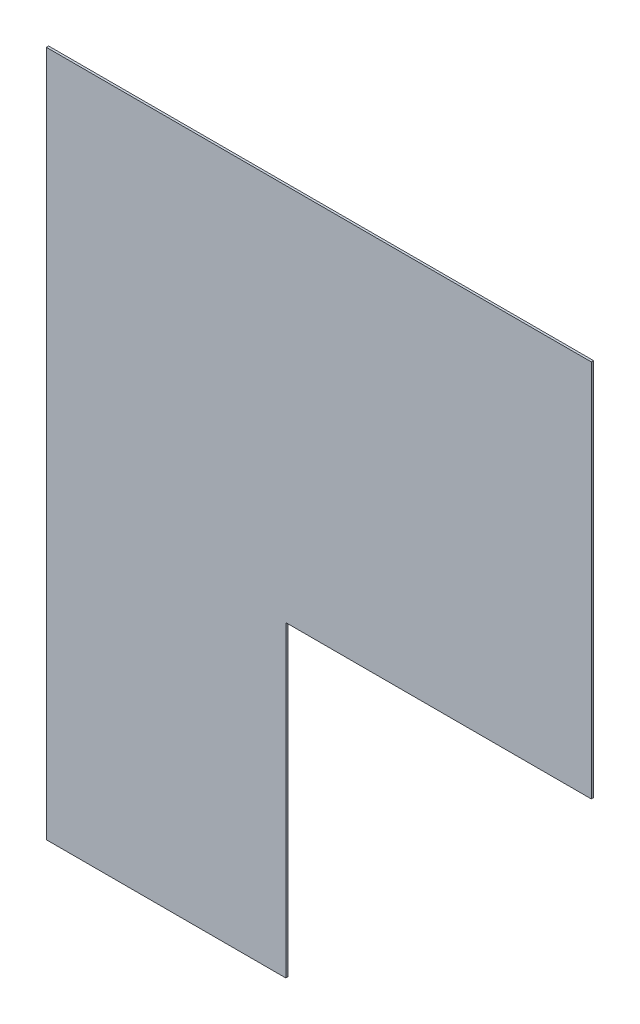
ISO-10303-21;
HEADER;
FILE_DESCRIPTION(('STEP AP214'),'2;1');
FILE_NAME('part.step','',(''),(''),'','','');
FILE_SCHEMA(('AUTOMOTIVE_DESIGN { 1 0 10303 214 1 1 1 1 }'));
ENDSEC;
DATA;
#1=APPLICATION_CONTEXT('core data for automotive mechanical design processes');
#2=APPLICATION_PROTOCOL_DEFINITION('international standard','automotive_design',2000,#1);
#3=PRODUCT_CONTEXT('',#1,'mechanical');
#4=PRODUCT('Part','Part','',(#3));
#5=PRODUCT_RELATED_PRODUCT_CATEGORY('part','',(#4));
#6=PRODUCT_DEFINITION_FORMATION('','',#4);
#7=PRODUCT_DEFINITION_CONTEXT('part definition',#1,'design');
#8=PRODUCT_DEFINITION('design','',#6,#7);
#9=PRODUCT_DEFINITION_SHAPE('','',#8);
#10=(LENGTH_UNIT() NAMED_UNIT(*) SI_UNIT(.MILLI.,.METRE.));
#11=(NAMED_UNIT(*) PLANE_ANGLE_UNIT() SI_UNIT($,.RADIAN.));
#12=(NAMED_UNIT(*) SI_UNIT($,.STERADIAN.) SOLID_ANGLE_UNIT());
#13=UNCERTAINTY_MEASURE_WITH_UNIT(LENGTH_MEASURE(1.E-05),#10,'distance_accuracy_value','');
#14=(GEOMETRIC_REPRESENTATION_CONTEXT(3) GLOBAL_UNCERTAINTY_ASSIGNED_CONTEXT((#13)) GLOBAL_UNIT_ASSIGNED_CONTEXT((#10,
#11,#12)) REPRESENTATION_CONTEXT('',''));
#15=CARTESIAN_POINT('',(0.,0.,0.));
#16=DIRECTION('',(0.,0.,1.));
#17=DIRECTION('',(1.,0.,0.));
#18=AXIS2_PLACEMENT_3D('',#15,#16,#17);
#19=CARTESIAN_POINT('',(0.,-1505.,-5.));
#20=DIRECTION('',(-1.,0.,0.));
#21=DIRECTION('',(0.,0.,1.));
#22=AXIS2_PLACEMENT_3D('',#19,#20,#21);
#23=PLANE('',#22);
#24=DIRECTION('',(0.,-1.,0.));
#25=VECTOR('',#24,1.);
#26=CARTESIAN_POINT('',(0.,-1505.,0.));
#27=LINE('',#26,#25);
#28=CARTESIAN_POINT('',(0.,0.,0.));
#29=VERTEX_POINT('',#28);
#30=CARTESIAN_POINT('',(0.,-1505.,0.));
#31=VERTEX_POINT('',#30);
#32=EDGE_CURVE('E127',#29,#31,#27,.T.);
#33=ORIENTED_EDGE('',*,*,#32,.F.);
#34=DIRECTION('',(0.,0.,1.));
#35=VECTOR('',#34,1.);
#36=CARTESIAN_POINT('',(0.,0.,-5.));
#37=LINE('',#36,#35);
#38=CARTESIAN_POINT('',(0.,0.,-5.));
#39=VERTEX_POINT('',#38);
#40=EDGE_CURVE('E63',#39,#29,#37,.T.);
#41=ORIENTED_EDGE('',*,*,#40,.F.);
#42=DIRECTION('',(0.,-1.,0.));
#43=VECTOR('',#42,1.);
#44=CARTESIAN_POINT('',(0.,-1505.,-5.));
#45=LINE('',#44,#43);
#46=CARTESIAN_POINT('',(0.,-1505.,-5.));
#47=VERTEX_POINT('',#46);
#48=EDGE_CURVE('E123',#39,#47,#45,.T.);
#49=ORIENTED_EDGE('',*,*,#48,.T.);
#50=DIRECTION('',(0.,0.,1.));
#51=VECTOR('',#50,1.);
#52=CARTESIAN_POINT('',(0.,-1505.,-5.));
#53=LINE('',#52,#51);
#54=EDGE_CURVE('E84',#47,#31,#53,.T.);
#55=ORIENTED_EDGE('',*,*,#54,.T.);
#56=EDGE_LOOP('',(#33,#41,#49,#55));
#57=FACE_BOUND('',#56,.T.);
#58=ADVANCED_FACE('F40',(#57),#23,.T.);
#59=CARTESIAN_POINT('',(0.,0.,-5.));
#60=DIRECTION('',(0.,1.,0.));
#61=DIRECTION('',(0.,0.,1.));
#62=AXIS2_PLACEMENT_3D('',#59,#60,#61);
#63=PLANE('',#62);
#64=DIRECTION('',(-1.,0.,0.));
#65=VECTOR('',#64,1.);
#66=CARTESIAN_POINT('',(0.,0.,0.));
#67=LINE('',#66,#65);
#68=CARTESIAN_POINT('',(1195.,0.,0.));
#69=VERTEX_POINT('',#68);
#70=EDGE_CURVE('E136',#69,#29,#67,.T.);
#71=ORIENTED_EDGE('',*,*,#70,.F.);
#72=DIRECTION('',(0.,0.,1.));
#73=VECTOR('',#72,1.);
#74=CARTESIAN_POINT('',(1195.,0.,-5.));
#75=LINE('',#74,#73);
#76=CARTESIAN_POINT('',(1195.,0.,-5.));
#77=VERTEX_POINT('',#76);
#78=EDGE_CURVE('E144',#77,#69,#75,.T.);
#79=ORIENTED_EDGE('',*,*,#78,.F.);
#80=DIRECTION('',(-1.,0.,0.));
#81=VECTOR('',#80,1.);
#82=CARTESIAN_POINT('',(0.,0.,-5.));
#83=LINE('',#82,#81);
#84=EDGE_CURVE('E119',#77,#39,#83,.T.);
#85=ORIENTED_EDGE('',*,*,#84,.T.);
#86=ORIENTED_EDGE('',*,*,#40,.T.);
#87=EDGE_LOOP('',(#71,#79,#85,#86));
#88=FACE_BOUND('',#87,.T.);
#89=ADVANCED_FACE('F165',(#88),#63,.T.);
#90=CARTESIAN_POINT('',(1195.,0.,-5.));
#91=DIRECTION('',(1.,0.,0.));
#92=DIRECTION('',(0.,1.,0.));
#93=AXIS2_PLACEMENT_3D('',#90,#91,#92);
#94=PLANE('',#93);
#95=DIRECTION('',(0.,0.,1.));
#96=VECTOR('',#95,1.);
#97=CARTESIAN_POINT('',(1195.,-830.,-5.));
#98=LINE('',#97,#96);
#99=CARTESIAN_POINT('',(1195.,-830.,-5.));
#100=VERTEX_POINT('',#99);
#101=CARTESIAN_POINT('',(1195.,-830.,0.));
#102=VERTEX_POINT('',#101);
#103=EDGE_CURVE('E54',#100,#102,#98,.T.);
#104=ORIENTED_EDGE('',*,*,#103,.F.);
#105=DIRECTION('',(0.,1.,0.));
#106=VECTOR('',#105,1.);
#107=CARTESIAN_POINT('',(1195.,0.,-5.));
#108=LINE('',#107,#106);
#109=EDGE_CURVE('E113',#100,#77,#108,.T.);
#110=ORIENTED_EDGE('',*,*,#109,.T.);
#111=ORIENTED_EDGE('',*,*,#78,.T.);
#112=DIRECTION('',(0.,1.,0.));
#113=VECTOR('',#112,1.);
#114=CARTESIAN_POINT('',(1195.,0.,0.));
#115=LINE('',#114,#113);
#116=EDGE_CURVE('E115',#102,#69,#115,.T.);
#117=ORIENTED_EDGE('',*,*,#116,.F.);
#118=EDGE_LOOP('',(#104,#110,#111,#117));
#119=FACE_BOUND('',#118,.T.);
#120=ADVANCED_FACE('F111',(#119),#94,.T.);
#121=CARTESIAN_POINT('',(1800.,-1505.,-5.));
#122=DIRECTION('',(0.,-1.,0.));
#123=DIRECTION('',(1.,0.,0.));
#124=AXIS2_PLACEMENT_3D('',#121,#122,#123);
#125=PLANE('',#124);
#126=DIRECTION('',(0.,0.,1.));
#127=VECTOR('',#126,1.);
#128=CARTESIAN_POINT('',(525.,-1505.,-5.));
#129=LINE('',#128,#127);
#130=CARTESIAN_POINT('',(525.,-1505.,-5.));
#131=VERTEX_POINT('',#130);
#132=CARTESIAN_POINT('',(525.,-1505.,0.));
#133=VERTEX_POINT('',#132);
#134=EDGE_CURVE('E131',#131,#133,#129,.T.);
#135=ORIENTED_EDGE('',*,*,#134,.T.);
#136=DIRECTION('',(1.,0.,0.));
#137=VECTOR('',#136,1.);
#138=CARTESIAN_POINT('',(1800.,-1505.,0.));
#139=LINE('',#138,#137);
#140=EDGE_CURVE('E130',#31,#133,#139,.T.);
#141=ORIENTED_EDGE('',*,*,#140,.F.);
#142=ORIENTED_EDGE('',*,*,#54,.F.);
#143=DIRECTION('',(1.,0.,0.));
#144=VECTOR('',#143,1.);
#145=CARTESIAN_POINT('',(1800.,-1505.,-5.));
#146=LINE('',#145,#144);
#147=EDGE_CURVE('E120',#47,#131,#146,.T.);
#148=ORIENTED_EDGE('',*,*,#147,.T.);
#149=EDGE_LOOP('',(#135,#141,#142,#148));
#150=FACE_BOUND('',#149,.T.);
#151=ADVANCED_FACE('F147',(#150),#125,.T.);
#152=CARTESIAN_POINT('',(0.,0.,-5.));
#153=DIRECTION('',(0.,0.,-1.));
#154=DIRECTION('',(-1.,0.,0.));
#155=AXIS2_PLACEMENT_3D('',#152,#153,#154);
#156=PLANE('',#155);
#157=DIRECTION('',(0.,-1.,0.));
#158=VECTOR('',#157,1.);
#159=CARTESIAN_POINT('',(525.,-1505.,-5.));
#160=LINE('',#159,#158);
#161=CARTESIAN_POINT('',(525.,-830.,-5.));
#162=VERTEX_POINT('',#161);
#163=EDGE_CURVE('E107',#162,#131,#160,.T.);
#164=ORIENTED_EDGE('',*,*,#163,.T.);
#165=ORIENTED_EDGE('',*,*,#147,.F.);
#166=ORIENTED_EDGE('',*,*,#48,.F.);
#167=ORIENTED_EDGE('',*,*,#84,.F.);
#168=ORIENTED_EDGE('',*,*,#109,.F.);
#169=DIRECTION('',(-1.,0.,0.));
#170=VECTOR('',#169,1.);
#171=CARTESIAN_POINT('',(525.,-830.,-5.));
#172=LINE('',#171,#170);
#173=EDGE_CURVE('E99',#100,#162,#172,.T.);
#174=ORIENTED_EDGE('',*,*,#173,.T.);
#175=EDGE_LOOP('',(#164,#165,#166,#167,#168,#174));
#176=FACE_BOUND('',#175,.T.);
#177=ADVANCED_FACE('F118',(#176),#156,.T.);
#178=CARTESIAN_POINT('',(0.,0.,0.));
#179=DIRECTION('',(0.,0.,-1.));
#180=DIRECTION('',(-1.,0.,0.));
#181=AXIS2_PLACEMENT_3D('',#178,#179,#180);
#182=PLANE('',#181);
#183=ORIENTED_EDGE('',*,*,#140,.T.);
#184=DIRECTION('',(0.,1.,0.));
#185=VECTOR('',#184,1.);
#186=CARTESIAN_POINT('',(525.,0.,0.));
#187=LINE('',#186,#185);
#188=CARTESIAN_POINT('',(525.,-830.,0.));
#189=VERTEX_POINT('',#188);
#190=EDGE_CURVE('E11',#133,#189,#187,.T.);
#191=ORIENTED_EDGE('',*,*,#190,.T.);
#192=DIRECTION('',(1.,0.,0.));
#193=VECTOR('',#192,1.);
#194=CARTESIAN_POINT('',(0.,-830.,0.));
#195=LINE('',#194,#193);
#196=EDGE_CURVE('E47',#189,#102,#195,.T.);
#197=ORIENTED_EDGE('',*,*,#196,.T.);
#198=ORIENTED_EDGE('',*,*,#116,.T.);
#199=ORIENTED_EDGE('',*,*,#70,.T.);
#200=ORIENTED_EDGE('',*,*,#32,.T.);
#201=EDGE_LOOP('',(#183,#191,#197,#198,#199,#200));
#202=FACE_BOUND('',#201,.T.);
#203=ADVANCED_FACE('F148',(#202),#182,.F.);
#204=CARTESIAN_POINT('',(525.,-1505.,-5.));
#205=DIRECTION('',(-1.,0.,0.));
#206=DIRECTION('',(0.,0.,1.));
#207=AXIS2_PLACEMENT_3D('',#204,#205,#206);
#208=PLANE('',#207);
#209=ORIENTED_EDGE('',*,*,#134,.F.);
#210=ORIENTED_EDGE('',*,*,#163,.F.);
#211=DIRECTION('',(0.,0.,1.));
#212=VECTOR('',#211,1.);
#213=CARTESIAN_POINT('',(525.,-830.,-5.));
#214=LINE('',#213,#212);
#215=EDGE_CURVE('E102',#162,#189,#214,.T.);
#216=ORIENTED_EDGE('',*,*,#215,.T.);
#217=ORIENTED_EDGE('',*,*,#190,.F.);
#218=EDGE_LOOP('',(#209,#210,#216,#217));
#219=FACE_BOUND('',#218,.T.);
#220=ADVANCED_FACE('F155',(#219),#208,.F.);
#221=CARTESIAN_POINT('',(525.,-830.,-5.));
#222=DIRECTION('',(0.,1.,0.));
#223=DIRECTION('',(0.,0.,1.));
#224=AXIS2_PLACEMENT_3D('',#221,#222,#223);
#225=PLANE('',#224);
#226=ORIENTED_EDGE('',*,*,#215,.F.);
#227=ORIENTED_EDGE('',*,*,#173,.F.);
#228=ORIENTED_EDGE('',*,*,#103,.T.);
#229=ORIENTED_EDGE('',*,*,#196,.F.);
#230=EDGE_LOOP('',(#226,#227,#228,#229));
#231=FACE_BOUND('',#230,.T.);
#232=ADVANCED_FACE('F100',(#231),#225,.F.);
#233=CLOSED_SHELL('',(#58,#89,#120,#151,#177,#203,#220,#232));
#234=MANIFOLD_SOLID_BREP('B2',#233);
#235=ADVANCED_BREP_SHAPE_REPRESENTATION('',(#18,#234),#14);
#236=SHAPE_DEFINITION_REPRESENTATION(#9,#235);
ENDSEC;
END-ISO-10303-21;
